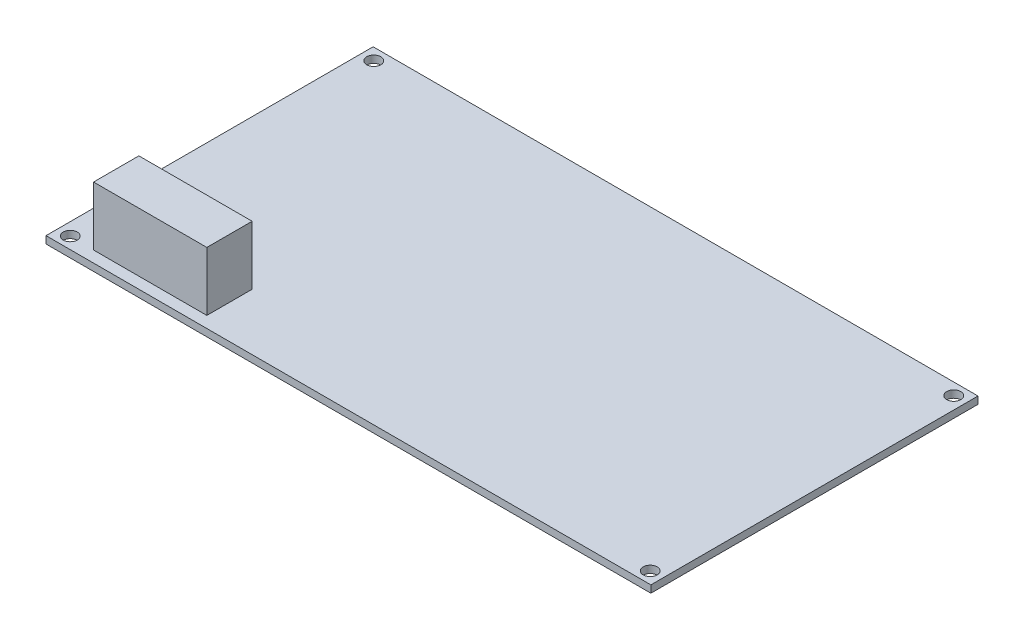
ISO-10303-21;
HEADER;
FILE_DESCRIPTION(('STEP AP214'),'2;1');
FILE_NAME('part.step','',(''),(''),'','','');
FILE_SCHEMA(('AUTOMOTIVE_DESIGN { 1 0 10303 214 1 1 1 1 }'));
ENDSEC;
DATA;
#1=APPLICATION_CONTEXT('core data for automotive mechanical design processes');
#2=APPLICATION_PROTOCOL_DEFINITION('international standard','automotive_design',2000,#1);
#3=PRODUCT_CONTEXT('',#1,'mechanical');
#4=PRODUCT('Part','Part','',(#3));
#5=PRODUCT_RELATED_PRODUCT_CATEGORY('part','',(#4));
#6=PRODUCT_DEFINITION_FORMATION('','',#4);
#7=PRODUCT_DEFINITION_CONTEXT('part definition',#1,'design');
#8=PRODUCT_DEFINITION('design','',#6,#7);
#9=PRODUCT_DEFINITION_SHAPE('','',#8);
#10=(LENGTH_UNIT() NAMED_UNIT(*) SI_UNIT(.MILLI.,.METRE.));
#11=(NAMED_UNIT(*) PLANE_ANGLE_UNIT() SI_UNIT($,.RADIAN.));
#12=(NAMED_UNIT(*) SI_UNIT($,.STERADIAN.) SOLID_ANGLE_UNIT());
#13=UNCERTAINTY_MEASURE_WITH_UNIT(LENGTH_MEASURE(1.E-05),#10,'distance_accuracy_value','');
#14=(GEOMETRIC_REPRESENTATION_CONTEXT(3) GLOBAL_UNCERTAINTY_ASSIGNED_CONTEXT((#13)) GLOBAL_UNIT_ASSIGNED_CONTEXT((#10,
#11,#12)) REPRESENTATION_CONTEXT('',''));
#15=CARTESIAN_POINT('',(0.,0.,0.));
#16=DIRECTION('',(0.,0.,1.));
#17=DIRECTION('',(1.,0.,0.));
#18=AXIS2_PLACEMENT_3D('',#15,#16,#17);
#19=CARTESIAN_POINT('',(0.,1.6,0.));
#20=DIRECTION('',(0.,1.,0.));
#21=DIRECTION('',(0.,0.,1.));
#22=AXIS2_PLACEMENT_3D('',#19,#20,#21);
#23=PLANE('',#22);
#24=CARTESIAN_POINT('',(2.75000000000004,1.6,-2.59999999999998));
#25=DIRECTION('',(0.,1.,0.));
#26=DIRECTION('',(0.,0.,1.));
#27=AXIS2_PLACEMENT_3D('',#24,#25,#26);
#28=CIRCLE('',#27,1.55);
#29=CARTESIAN_POINT('',(2.75000000000004,1.6,-1.04999999999998));
#30=VERTEX_POINT('',#29);
#31=EDGE_CURVE('E140',#30,#30,#28,.T.);
#32=ORIENTED_EDGE('',*,*,#31,.F.);
#33=EDGE_LOOP('',(#32));
#34=FACE_BOUND('',#33,.T.);
#35=CARTESIAN_POINT('',(130.75,1.6,-2.60000000000003));
#36=DIRECTION('',(0.,1.,0.));
#37=DIRECTION('',(0.,0.,1.));
#38=AXIS2_PLACEMENT_3D('',#35,#36,#37);
#39=CIRCLE('',#38,1.54999999999999);
#40=CARTESIAN_POINT('',(130.75,1.6,-1.05000000000004));
#41=VERTEX_POINT('',#40);
#42=EDGE_CURVE('E143',#41,#41,#39,.T.);
#43=ORIENTED_EDGE('',*,*,#42,.F.);
#44=EDGE_LOOP('',(#43));
#45=FACE_BOUND('',#44,.T.);
#46=CARTESIAN_POINT('',(130.75,1.6,-69.6));
#47=DIRECTION('',(0.,1.,0.));
#48=DIRECTION('',(0.,0.,1.));
#49=AXIS2_PLACEMENT_3D('',#46,#47,#48);
#50=CIRCLE('',#49,1.54999999999999);
#51=CARTESIAN_POINT('',(130.75,1.6,-68.05));
#52=VERTEX_POINT('',#51);
#53=EDGE_CURVE('E147',#52,#52,#50,.T.);
#54=ORIENTED_EDGE('',*,*,#53,.F.);
#55=EDGE_LOOP('',(#54));
#56=FACE_BOUND('',#55,.T.);
#57=CARTESIAN_POINT('',(2.75000000000001,1.6,-69.6));
#58=DIRECTION('',(0.,1.,0.));
#59=DIRECTION('',(0.,0.,1.));
#60=AXIS2_PLACEMENT_3D('',#57,#58,#59);
#61=CIRCLE('',#60,1.55);
#62=CARTESIAN_POINT('',(2.75000000000001,1.6,-68.05));
#63=VERTEX_POINT('',#62);
#64=EDGE_CURVE('E150',#63,#63,#61,.T.);
#65=ORIENTED_EDGE('',*,*,#64,.F.);
#66=EDGE_LOOP('',(#65));
#67=FACE_BOUND('',#66,.T.);
#68=DIRECTION('',(1.,0.,0.));
#69=VECTOR('',#68,1.);
#70=CARTESIAN_POINT('',(0.,1.6,0.));
#71=LINE('',#70,#69);
#72=CARTESIAN_POINT('',(0.,1.6,0.));
#73=VERTEX_POINT('',#72);
#74=CARTESIAN_POINT('',(133.5,1.6,0.));
#75=VERTEX_POINT('',#74);
#76=EDGE_CURVE('E153',#73,#75,#71,.T.);
#77=ORIENTED_EDGE('',*,*,#76,.T.);
#78=DIRECTION('',(0.,0.,-1.));
#79=VECTOR('',#78,1.);
#80=CARTESIAN_POINT('',(133.5,1.6,0.));
#81=LINE('',#80,#79);
#82=CARTESIAN_POINT('',(133.5,1.6,-72.2));
#83=VERTEX_POINT('',#82);
#84=EDGE_CURVE('E84',#75,#83,#81,.T.);
#85=ORIENTED_EDGE('',*,*,#84,.T.);
#86=DIRECTION('',(1.,0.,0.));
#87=VECTOR('',#86,1.);
#88=CARTESIAN_POINT('',(0.,1.6,-72.2));
#89=LINE('',#88,#87);
#90=CARTESIAN_POINT('',(0.,1.6,-72.2));
#91=VERTEX_POINT('',#90);
#92=EDGE_CURVE('E156',#91,#83,#89,.T.);
#93=ORIENTED_EDGE('',*,*,#92,.F.);
#94=DIRECTION('',(0.,0.,-1.));
#95=VECTOR('',#94,1.);
#96=CARTESIAN_POINT('',(0.,1.6,0.));
#97=LINE('',#96,#95);
#98=EDGE_CURVE('E159',#73,#91,#97,.T.);
#99=ORIENTED_EDGE('',*,*,#98,.F.);
#100=EDGE_LOOP('',(#77,#85,#93,#99));
#101=FACE_BOUND('',#100,.T.);
#102=DIRECTION('',(1.,0.,0.));
#103=VECTOR('',#102,1.);
#104=CARTESIAN_POINT('',(8.,1.6,-2.5));
#105=LINE('',#104,#103);
#106=CARTESIAN_POINT('',(8.,1.6,-2.5));
#107=VERTEX_POINT('',#106);
#108=CARTESIAN_POINT('',(33.,1.6,-2.5));
#109=VERTEX_POINT('',#108);
#110=EDGE_CURVE('E329',#107,#109,#105,.T.);
#111=ORIENTED_EDGE('',*,*,#110,.F.);
#112=DIRECTION('',(0.,0.,1.));
#113=VECTOR('',#112,1.);
#114=CARTESIAN_POINT('',(8.,1.6,-2.5));
#115=LINE('',#114,#113);
#116=CARTESIAN_POINT('',(8.,1.6,-12.5));
#117=VERTEX_POINT('',#116);
#118=EDGE_CURVE('E130',#117,#107,#115,.T.);
#119=ORIENTED_EDGE('',*,*,#118,.F.);
#120=DIRECTION('',(-1.,0.,0.));
#121=VECTOR('',#120,1.);
#122=CARTESIAN_POINT('',(8.,1.6,-12.5));
#123=LINE('',#122,#121);
#124=CARTESIAN_POINT('',(33.,1.6,-12.5));
#125=VERTEX_POINT('',#124);
#126=EDGE_CURVE('E126',#125,#117,#123,.T.);
#127=ORIENTED_EDGE('',*,*,#126,.F.);
#128=DIRECTION('',(0.,0.,-1.));
#129=VECTOR('',#128,1.);
#130=CARTESIAN_POINT('',(33.,1.6,-2.5));
#131=LINE('',#130,#129);
#132=EDGE_CURVE('E326',#109,#125,#131,.T.);
#133=ORIENTED_EDGE('',*,*,#132,.F.);
#134=EDGE_LOOP('',(#111,#119,#127,#133));
#135=FACE_BOUND('',#134,.T.);
#136=ADVANCED_FACE('F34',(#34,#45,#56,#67,#101,#135),#23,.T.);
#137=CARTESIAN_POINT('',(0.,1.6,0.));
#138=DIRECTION('',(0.,0.,-1.));
#139=DIRECTION('',(-1.,0.,0.));
#140=AXIS2_PLACEMENT_3D('',#137,#138,#139);
#141=PLANE('',#140);
#142=DIRECTION('',(1.,0.,0.));
#143=VECTOR('',#142,1.);
#144=CARTESIAN_POINT('',(0.,0.,0.));
#145=LINE('',#144,#143);
#146=CARTESIAN_POINT('',(0.,0.,0.));
#147=VERTEX_POINT('',#146);
#148=CARTESIAN_POINT('',(133.5,0.,0.));
#149=VERTEX_POINT('',#148);
#150=EDGE_CURVE('E169',#147,#149,#145,.T.);
#151=ORIENTED_EDGE('',*,*,#150,.T.);
#152=DIRECTION('',(0.,-1.,0.));
#153=VECTOR('',#152,1.);
#154=CARTESIAN_POINT('',(133.5,1.6,0.));
#155=LINE('',#154,#153);
#156=EDGE_CURVE('E11',#75,#149,#155,.T.);
#157=ORIENTED_EDGE('',*,*,#156,.F.);
#158=ORIENTED_EDGE('',*,*,#76,.F.);
#159=DIRECTION('',(0.,-1.,0.));
#160=VECTOR('',#159,1.);
#161=CARTESIAN_POINT('',(0.,1.6,0.));
#162=LINE('',#161,#160);
#163=EDGE_CURVE('E58',#73,#147,#162,.T.);
#164=ORIENTED_EDGE('',*,*,#163,.T.);
#165=EDGE_LOOP('',(#151,#157,#158,#164));
#166=FACE_BOUND('',#165,.T.);
#167=ADVANCED_FACE('F193',(#166),#141,.F.);
#168=CARTESIAN_POINT('',(133.5,1.6,0.));
#169=DIRECTION('',(-1.,0.,0.));
#170=DIRECTION('',(0.,0.,1.));
#171=AXIS2_PLACEMENT_3D('',#168,#169,#170);
#172=PLANE('',#171);
#173=DIRECTION('',(0.,0.,-1.));
#174=VECTOR('',#173,1.);
#175=CARTESIAN_POINT('',(133.5,0.,0.));
#176=LINE('',#175,#174);
#177=CARTESIAN_POINT('',(133.5,0.,-72.2));
#178=VERTEX_POINT('',#177);
#179=EDGE_CURVE('E171',#149,#178,#176,.T.);
#180=ORIENTED_EDGE('',*,*,#179,.T.);
#181=DIRECTION('',(0.,-1.,0.));
#182=VECTOR('',#181,1.);
#183=CARTESIAN_POINT('',(133.5,1.6,-72.2));
#184=LINE('',#183,#182);
#185=EDGE_CURVE('E42',#83,#178,#184,.T.);
#186=ORIENTED_EDGE('',*,*,#185,.F.);
#187=ORIENTED_EDGE('',*,*,#84,.F.);
#188=ORIENTED_EDGE('',*,*,#156,.T.);
#189=EDGE_LOOP('',(#180,#186,#187,#188));
#190=FACE_BOUND('',#189,.T.);
#191=ADVANCED_FACE('F185',(#190),#172,.F.);
#192=CARTESIAN_POINT('',(0.,1.6,-72.2));
#193=DIRECTION('',(0.,0.,-1.));
#194=DIRECTION('',(-1.,0.,0.));
#195=AXIS2_PLACEMENT_3D('',#192,#193,#194);
#196=PLANE('',#195);
#197=DIRECTION('',(1.,0.,0.));
#198=VECTOR('',#197,1.);
#199=CARTESIAN_POINT('',(0.,0.,-72.2));
#200=LINE('',#199,#198);
#201=CARTESIAN_POINT('',(0.,0.,-72.2));
#202=VERTEX_POINT('',#201);
#203=EDGE_CURVE('E174',#202,#178,#200,.T.);
#204=ORIENTED_EDGE('',*,*,#203,.F.);
#205=DIRECTION('',(0.,-1.,0.));
#206=VECTOR('',#205,1.);
#207=CARTESIAN_POINT('',(0.,1.6,-72.2));
#208=LINE('',#207,#206);
#209=EDGE_CURVE('E180',#91,#202,#208,.T.);
#210=ORIENTED_EDGE('',*,*,#209,.F.);
#211=ORIENTED_EDGE('',*,*,#92,.T.);
#212=ORIENTED_EDGE('',*,*,#185,.T.);
#213=EDGE_LOOP('',(#204,#210,#211,#212));
#214=FACE_BOUND('',#213,.T.);
#215=ADVANCED_FACE('F183',(#214),#196,.T.);
#216=CARTESIAN_POINT('',(2.75000000000001,1.6,-69.6));
#217=DIRECTION('',(0.,-1.,0.));
#218=DIRECTION('',(0.,0.,-1.));
#219=AXIS2_PLACEMENT_3D('',#216,#217,#218);
#220=CYLINDRICAL_SURFACE('',#219,1.55);
#221=ORIENTED_EDGE('',*,*,#64,.T.);
#222=EDGE_LOOP('',(#221));
#223=FACE_BOUND('',#222,.T.);
#224=CARTESIAN_POINT('',(2.75000000000001,0.,-69.6));
#225=DIRECTION('',(0.,1.,0.));
#226=DIRECTION('',(0.,0.,1.));
#227=AXIS2_PLACEMENT_3D('',#224,#225,#226);
#228=CIRCLE('',#227,1.55);
#229=CARTESIAN_POINT('',(2.75000000000001,0.,-68.05));
#230=VERTEX_POINT('',#229);
#231=EDGE_CURVE('E166',#230,#230,#228,.T.);
#232=ORIENTED_EDGE('',*,*,#231,.F.);
#233=EDGE_LOOP('',(#232));
#234=FACE_BOUND('',#233,.T.);
#235=ADVANCED_FACE('F205',(#223,#234),#220,.F.);
#236=CARTESIAN_POINT('',(130.75,1.6,-69.6));
#237=DIRECTION('',(0.,-1.,0.));
#238=DIRECTION('',(0.,0.,-1.));
#239=AXIS2_PLACEMENT_3D('',#236,#237,#238);
#240=CYLINDRICAL_SURFACE('',#239,1.54999999999999);
#241=ORIENTED_EDGE('',*,*,#53,.T.);
#242=EDGE_LOOP('',(#241));
#243=FACE_BOUND('',#242,.T.);
#244=CARTESIAN_POINT('',(130.75,0.,-69.6));
#245=DIRECTION('',(0.,1.,0.));
#246=DIRECTION('',(0.,0.,1.));
#247=AXIS2_PLACEMENT_3D('',#244,#245,#246);
#248=CIRCLE('',#247,1.54999999999999);
#249=CARTESIAN_POINT('',(130.75,0.,-68.05));
#250=VERTEX_POINT('',#249);
#251=EDGE_CURVE('E163',#250,#250,#248,.T.);
#252=ORIENTED_EDGE('',*,*,#251,.F.);
#253=EDGE_LOOP('',(#252));
#254=FACE_BOUND('',#253,.T.);
#255=ADVANCED_FACE('F208',(#243,#254),#240,.F.);
#256=CARTESIAN_POINT('',(130.75,1.6,-2.60000000000003));
#257=DIRECTION('',(0.,-1.,0.));
#258=DIRECTION('',(0.,0.,-1.));
#259=AXIS2_PLACEMENT_3D('',#256,#257,#258);
#260=CYLINDRICAL_SURFACE('',#259,1.54999999999999);
#261=ORIENTED_EDGE('',*,*,#42,.T.);
#262=EDGE_LOOP('',(#261));
#263=FACE_BOUND('',#262,.T.);
#264=CARTESIAN_POINT('',(130.75,0.,-2.60000000000003));
#265=DIRECTION('',(0.,1.,0.));
#266=DIRECTION('',(0.,0.,1.));
#267=AXIS2_PLACEMENT_3D('',#264,#265,#266);
#268=CIRCLE('',#267,1.54999999999999);
#269=CARTESIAN_POINT('',(130.75,0.,-1.05000000000004));
#270=VERTEX_POINT('',#269);
#271=EDGE_CURVE('E135',#270,#270,#268,.T.);
#272=ORIENTED_EDGE('',*,*,#271,.F.);
#273=EDGE_LOOP('',(#272));
#274=FACE_BOUND('',#273,.T.);
#275=ADVANCED_FACE('F211',(#263,#274),#260,.F.);
#276=CARTESIAN_POINT('',(2.75000000000004,1.6,-2.59999999999998));
#277=DIRECTION('',(0.,-1.,0.));
#278=DIRECTION('',(0.,0.,-1.));
#279=AXIS2_PLACEMENT_3D('',#276,#277,#278);
#280=CYLINDRICAL_SURFACE('',#279,1.55);
#281=ORIENTED_EDGE('',*,*,#31,.T.);
#282=EDGE_LOOP('',(#281));
#283=FACE_BOUND('',#282,.T.);
#284=CARTESIAN_POINT('',(2.75000000000004,0.,-2.59999999999998));
#285=DIRECTION('',(0.,1.,0.));
#286=DIRECTION('',(0.,0.,1.));
#287=AXIS2_PLACEMENT_3D('',#284,#285,#286);
#288=CIRCLE('',#287,1.55);
#289=CARTESIAN_POINT('',(2.75000000000004,0.,-1.04999999999998));
#290=VERTEX_POINT('',#289);
#291=EDGE_CURVE('E132',#290,#290,#288,.T.);
#292=ORIENTED_EDGE('',*,*,#291,.F.);
#293=EDGE_LOOP('',(#292));
#294=FACE_BOUND('',#293,.T.);
#295=ADVANCED_FACE('F36',(#283,#294),#280,.F.);
#296=CARTESIAN_POINT('',(0.,1.6,0.));
#297=DIRECTION('',(-1.,0.,0.));
#298=DIRECTION('',(0.,0.,1.));
#299=AXIS2_PLACEMENT_3D('',#296,#297,#298);
#300=PLANE('',#299);
#301=DIRECTION('',(0.,0.,-1.));
#302=VECTOR('',#301,1.);
#303=CARTESIAN_POINT('',(0.,0.,0.));
#304=LINE('',#303,#302);
#305=EDGE_CURVE('E144',#147,#202,#304,.T.);
#306=ORIENTED_EDGE('',*,*,#305,.F.);
#307=ORIENTED_EDGE('',*,*,#163,.F.);
#308=ORIENTED_EDGE('',*,*,#98,.T.);
#309=ORIENTED_EDGE('',*,*,#209,.T.);
#310=EDGE_LOOP('',(#306,#307,#308,#309));
#311=FACE_BOUND('',#310,.T.);
#312=ADVANCED_FACE('F189',(#311),#300,.T.);
#313=CARTESIAN_POINT('',(0.,0.,0.));
#314=DIRECTION('',(0.,1.,0.));
#315=DIRECTION('',(0.,0.,1.));
#316=AXIS2_PLACEMENT_3D('',#313,#314,#315);
#317=PLANE('',#316);
#318=ORIENTED_EDGE('',*,*,#291,.T.);
#319=EDGE_LOOP('',(#318));
#320=FACE_BOUND('',#319,.T.);
#321=ORIENTED_EDGE('',*,*,#271,.T.);
#322=EDGE_LOOP('',(#321));
#323=FACE_BOUND('',#322,.T.);
#324=ORIENTED_EDGE('',*,*,#251,.T.);
#325=EDGE_LOOP('',(#324));
#326=FACE_BOUND('',#325,.T.);
#327=ORIENTED_EDGE('',*,*,#231,.T.);
#328=EDGE_LOOP('',(#327));
#329=FACE_BOUND('',#328,.T.);
#330=ORIENTED_EDGE('',*,*,#150,.F.);
#331=ORIENTED_EDGE('',*,*,#305,.T.);
#332=ORIENTED_EDGE('',*,*,#203,.T.);
#333=ORIENTED_EDGE('',*,*,#179,.F.);
#334=EDGE_LOOP('',(#330,#331,#332,#333));
#335=FACE_BOUND('',#334,.T.);
#336=ADVANCED_FACE('F188',(#320,#323,#326,#329,#335),#317,.F.);
#337=CARTESIAN_POINT('',(8.,14.6,-2.5));
#338=DIRECTION('',(1.,0.,0.));
#339=DIRECTION('',(0.,0.,-1.));
#340=AXIS2_PLACEMENT_3D('',#337,#338,#339);
#341=PLANE('',#340);
#342=ORIENTED_EDGE('',*,*,#118,.T.);
#343=DIRECTION('',(0.,-1.,0.));
#344=VECTOR('',#343,1.);
#345=CARTESIAN_POINT('',(8.,14.6,-2.5));
#346=LINE('',#345,#344);
#347=CARTESIAN_POINT('',(8.,14.6,-2.5));
#348=VERTEX_POINT('',#347);
#349=EDGE_CURVE('E111',#348,#107,#346,.T.);
#350=ORIENTED_EDGE('',*,*,#349,.F.);
#351=DIRECTION('',(0.,0.,1.));
#352=VECTOR('',#351,1.);
#353=CARTESIAN_POINT('',(8.,14.6,-2.5));
#354=LINE('',#353,#352);
#355=CARTESIAN_POINT('',(8.,14.6,-12.5));
#356=VERTEX_POINT('',#355);
#357=EDGE_CURVE('E118',#356,#348,#354,.T.);
#358=ORIENTED_EDGE('',*,*,#357,.F.);
#359=DIRECTION('',(0.,-1.,0.));
#360=VECTOR('',#359,1.);
#361=CARTESIAN_POINT('',(8.,14.6,-12.5));
#362=LINE('',#361,#360);
#363=EDGE_CURVE('E324',#356,#117,#362,.T.);
#364=ORIENTED_EDGE('',*,*,#363,.T.);
#365=EDGE_LOOP('',(#342,#350,#358,#364));
#366=FACE_BOUND('',#365,.T.);
#367=ADVANCED_FACE('F128',(#366),#341,.F.);
#368=CARTESIAN_POINT('',(8.,14.6,-2.5));
#369=DIRECTION('',(0.,0.,-1.));
#370=DIRECTION('',(-1.,0.,0.));
#371=AXIS2_PLACEMENT_3D('',#368,#369,#370);
#372=PLANE('',#371);
#373=ORIENTED_EDGE('',*,*,#110,.T.);
#374=DIRECTION('',(0.,-1.,0.));
#375=VECTOR('',#374,1.);
#376=CARTESIAN_POINT('',(33.,14.6,-2.5));
#377=LINE('',#376,#375);
#378=CARTESIAN_POINT('',(33.,14.6,-2.5));
#379=VERTEX_POINT('',#378);
#380=EDGE_CURVE('E114',#379,#109,#377,.T.);
#381=ORIENTED_EDGE('',*,*,#380,.F.);
#382=DIRECTION('',(1.,0.,0.));
#383=VECTOR('',#382,1.);
#384=CARTESIAN_POINT('',(8.,14.6,-2.5));
#385=LINE('',#384,#383);
#386=EDGE_CURVE('E107',#348,#379,#385,.T.);
#387=ORIENTED_EDGE('',*,*,#386,.F.);
#388=ORIENTED_EDGE('',*,*,#349,.T.);
#389=EDGE_LOOP('',(#373,#381,#387,#388));
#390=FACE_BOUND('',#389,.T.);
#391=ADVANCED_FACE('F109',(#390),#372,.F.);
#392=CARTESIAN_POINT('',(33.,14.6,-2.5));
#393=DIRECTION('',(-1.,0.,0.));
#394=DIRECTION('',(0.,0.,1.));
#395=AXIS2_PLACEMENT_3D('',#392,#393,#394);
#396=PLANE('',#395);
#397=ORIENTED_EDGE('',*,*,#132,.T.);
#398=DIRECTION('',(0.,-1.,0.));
#399=VECTOR('',#398,1.);
#400=CARTESIAN_POINT('',(33.,14.6,-12.5));
#401=LINE('',#400,#399);
#402=CARTESIAN_POINT('',(33.,14.6,-12.5));
#403=VERTEX_POINT('',#402);
#404=EDGE_CURVE('E49',#403,#125,#401,.T.);
#405=ORIENTED_EDGE('',*,*,#404,.F.);
#406=DIRECTION('',(0.,0.,-1.));
#407=VECTOR('',#406,1.);
#408=CARTESIAN_POINT('',(33.,14.6,-2.5));
#409=LINE('',#408,#407);
#410=EDGE_CURVE('E117',#379,#403,#409,.T.);
#411=ORIENTED_EDGE('',*,*,#410,.F.);
#412=ORIENTED_EDGE('',*,*,#380,.T.);
#413=EDGE_LOOP('',(#397,#405,#411,#412));
#414=FACE_BOUND('',#413,.T.);
#415=ADVANCED_FACE('F293',(#414),#396,.F.);
#416=CARTESIAN_POINT('',(8.,14.6,-12.5));
#417=DIRECTION('',(0.,0.,1.));
#418=DIRECTION('',(1.,0.,0.));
#419=AXIS2_PLACEMENT_3D('',#416,#417,#418);
#420=PLANE('',#419);
#421=ORIENTED_EDGE('',*,*,#126,.T.);
#422=ORIENTED_EDGE('',*,*,#363,.F.);
#423=DIRECTION('',(-1.,0.,0.));
#424=VECTOR('',#423,1.);
#425=CARTESIAN_POINT('',(8.,14.6,-12.5));
#426=LINE('',#425,#424);
#427=EDGE_CURVE('E122',#403,#356,#426,.T.);
#428=ORIENTED_EDGE('',*,*,#427,.F.);
#429=ORIENTED_EDGE('',*,*,#404,.T.);
#430=EDGE_LOOP('',(#421,#422,#428,#429));
#431=FACE_BOUND('',#430,.T.);
#432=ADVANCED_FACE('F302',(#431),#420,.F.);
#433=CARTESIAN_POINT('',(0.,14.6,0.));
#434=DIRECTION('',(0.,-1.,0.));
#435=DIRECTION('',(0.,0.,-1.));
#436=AXIS2_PLACEMENT_3D('',#433,#434,#435);
#437=PLANE('',#436);
#438=ORIENTED_EDGE('',*,*,#357,.T.);
#439=ORIENTED_EDGE('',*,*,#386,.T.);
#440=ORIENTED_EDGE('',*,*,#410,.T.);
#441=ORIENTED_EDGE('',*,*,#427,.T.);
#442=EDGE_LOOP('',(#438,#439,#440,#441));
#443=FACE_BOUND('',#442,.T.);
#444=ADVANCED_FACE('F121',(#443),#437,.F.);
#445=CLOSED_SHELL('',(#136,#167,#191,#215,#235,#255,#275,#295,#312,#336,#367,#391,#415,#432,#444));
#446=MANIFOLD_SOLID_BREP('B2',#445);
#447=ADVANCED_BREP_SHAPE_REPRESENTATION('',(#18,#446),#14);
#448=SHAPE_DEFINITION_REPRESENTATION(#9,#447);
ENDSEC;
END-ISO-10303-21;
